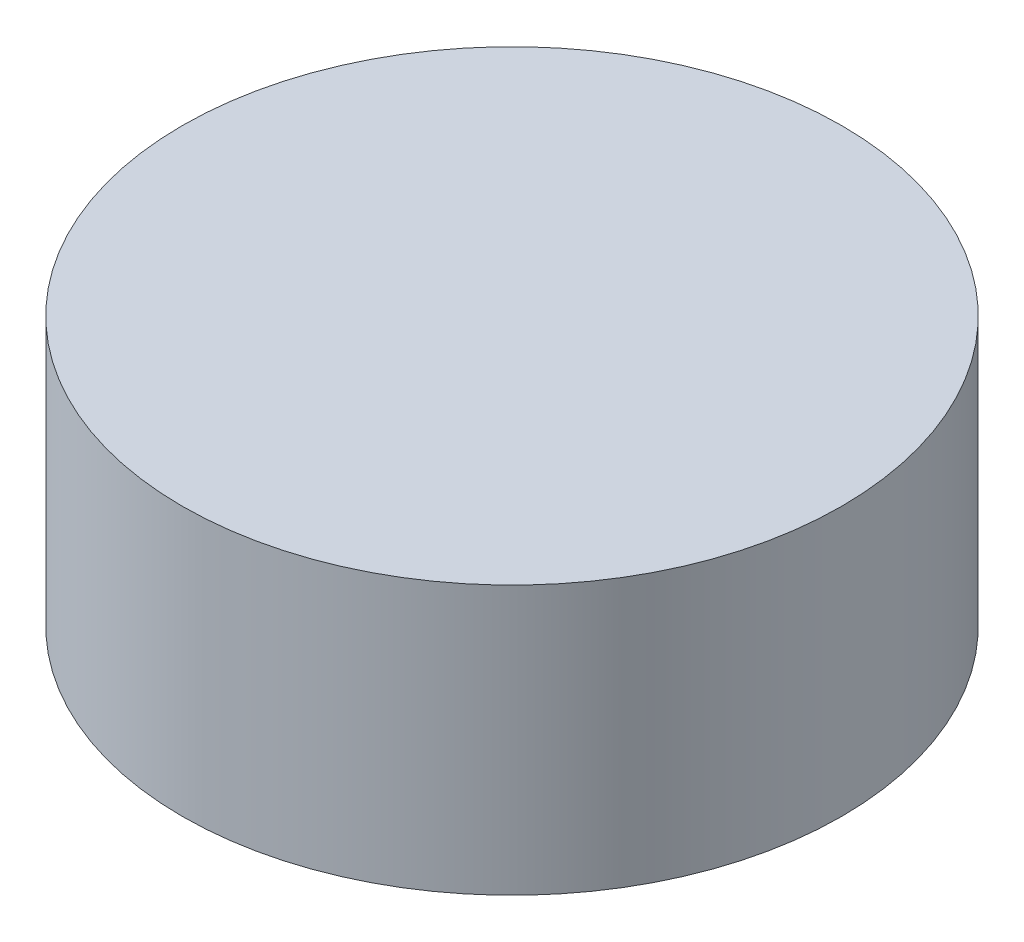
ISO-10303-21;
HEADER;
FILE_DESCRIPTION(('STEP AP214'),'2;1');
FILE_NAME('part.step','',(''),(''),'','','');
FILE_SCHEMA(('AUTOMOTIVE_DESIGN { 1 0 10303 214 1 1 1 1 }'));
ENDSEC;
DATA;
#1=APPLICATION_CONTEXT('core data for automotive mechanical design processes');
#2=APPLICATION_PROTOCOL_DEFINITION('international standard','automotive_design',2000,#1);
#3=PRODUCT_CONTEXT('',#1,'mechanical');
#4=PRODUCT('Part','Part','',(#3));
#5=PRODUCT_RELATED_PRODUCT_CATEGORY('part','',(#4));
#6=PRODUCT_DEFINITION_FORMATION('','',#4);
#7=PRODUCT_DEFINITION_CONTEXT('part definition',#1,'design');
#8=PRODUCT_DEFINITION('design','',#6,#7);
#9=PRODUCT_DEFINITION_SHAPE('','',#8);
#10=(LENGTH_UNIT() NAMED_UNIT(*) SI_UNIT(.MILLI.,.METRE.));
#11=(NAMED_UNIT(*) PLANE_ANGLE_UNIT() SI_UNIT($,.RADIAN.));
#12=(NAMED_UNIT(*) SI_UNIT($,.STERADIAN.) SOLID_ANGLE_UNIT());
#13=UNCERTAINTY_MEASURE_WITH_UNIT(LENGTH_MEASURE(1.E-05),#10,'distance_accuracy_value','');
#14=(GEOMETRIC_REPRESENTATION_CONTEXT(3) GLOBAL_UNCERTAINTY_ASSIGNED_CONTEXT((#13)) GLOBAL_UNIT_ASSIGNED_CONTEXT((#10,
#11,#12)) REPRESENTATION_CONTEXT('',''));
#15=CARTESIAN_POINT('',(0.,0.,0.));
#16=DIRECTION('',(0.,0.,1.));
#17=DIRECTION('',(1.,0.,0.));
#18=AXIS2_PLACEMENT_3D('',#15,#16,#17);
#19=CARTESIAN_POINT('',(322.004322273203,33.,11.0479338377505));
#20=DIRECTION('',(0.,1.,0.));
#21=DIRECTION('',(0.,0.,1.));
#22=AXIS2_PLACEMENT_3D('',#19,#20,#21);
#23=PLANE('',#22);
#24=CARTESIAN_POINT('',(358.825322273203,33.,47.8689338377505));
#25=DIRECTION('',(0.,-1.,0.));
#26=DIRECTION('',(0.,0.,-1.));
#27=AXIS2_PLACEMENT_3D('',#24,#25,#26);
#28=CIRCLE('',#27,36.82);
#29=CARTESIAN_POINT('',(358.825322273203,33.,11.0489338377505));
#30=VERTEX_POINT('',#29);
#31=EDGE_CURVE('E18',#30,#30,#28,.T.);
#32=ORIENTED_EDGE('',*,*,#31,.F.);
#33=EDGE_LOOP('',(#32));
#34=FACE_BOUND('',#33,.T.);
#35=ADVANCED_FACE('F14',(#34),#23,.T.);
#36=CARTESIAN_POINT('',(322.004322273203,3.,84.6899338377505));
#37=DIRECTION('',(0.,-1.,0.));
#38=DIRECTION('',(0.,0.,-1.));
#39=AXIS2_PLACEMENT_3D('',#36,#37,#38);
#40=PLANE('',#39);
#41=CARTESIAN_POINT('',(358.825322273203,3.,47.8689338377505));
#42=DIRECTION('',(0.,-1.,0.));
#43=DIRECTION('',(0.,0.,-1.));
#44=AXIS2_PLACEMENT_3D('',#41,#42,#43);
#45=CIRCLE('',#44,36.82);
#46=CARTESIAN_POINT('',(358.825322273203,3.,11.0489338377505));
#47=VERTEX_POINT('',#46);
#48=EDGE_CURVE('E10',#47,#47,#45,.F.);
#49=ORIENTED_EDGE('',*,*,#48,.F.);
#50=EDGE_LOOP('',(#49));
#51=FACE_BOUND('',#50,.T.);
#52=ADVANCED_FACE('F32',(#51),#40,.T.);
#53=CARTESIAN_POINT('',(358.825322273203,33.,47.8689338377505));
#54=DIRECTION('',(0.,-1.,0.));
#55=DIRECTION('',(0.,0.,-1.));
#56=AXIS2_PLACEMENT_3D('',#53,#54,#55);
#57=CYLINDRICAL_SURFACE('',#56,36.82);
#58=ORIENTED_EDGE('',*,*,#48,.T.);
#59=EDGE_LOOP('',(#58));
#60=FACE_BOUND('',#59,.T.);
#61=ORIENTED_EDGE('',*,*,#31,.T.);
#62=EDGE_LOOP('',(#61));
#63=FACE_BOUND('',#62,.T.);
#64=ADVANCED_FACE('F16',(#60,#63),#57,.T.);
#65=CLOSED_SHELL('',(#35,#52,#64));
#66=MANIFOLD_SOLID_BREP('B1',#65);
#67=ADVANCED_BREP_SHAPE_REPRESENTATION('',(#18,#66),#14);
#68=SHAPE_DEFINITION_REPRESENTATION(#9,#67);
ENDSEC;
END-ISO-10303-21;
